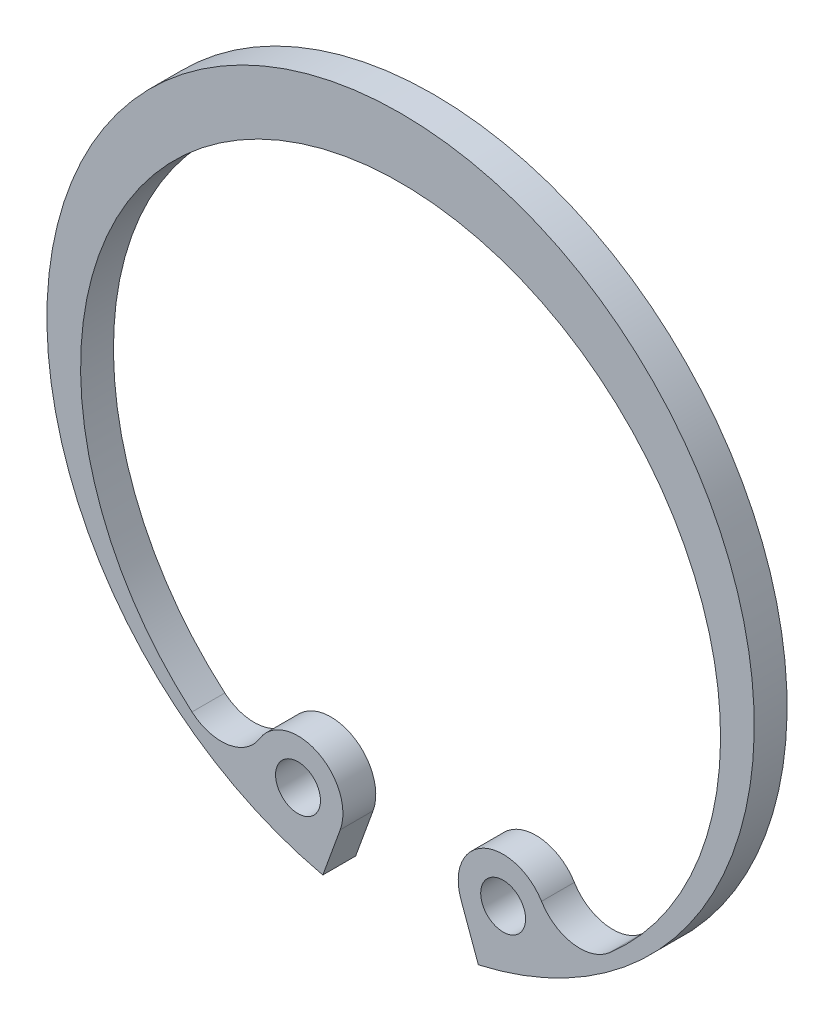
ISO-10303-21;
HEADER;
FILE_DESCRIPTION(('STEP AP214'),'2;1');
FILE_NAME('part.step','',(''),(''),'','','');
FILE_SCHEMA(('AUTOMOTIVE_DESIGN { 1 0 10303 214 1 1 1 1 }'));
ENDSEC;
DATA;
#1=APPLICATION_CONTEXT('core data for automotive mechanical design processes');
#2=APPLICATION_PROTOCOL_DEFINITION('international standard','automotive_design',2000,#1);
#3=PRODUCT_CONTEXT('',#1,'mechanical');
#4=PRODUCT('Part','Part','',(#3));
#5=PRODUCT_RELATED_PRODUCT_CATEGORY('part','',(#4));
#6=PRODUCT_DEFINITION_FORMATION('','',#4);
#7=PRODUCT_DEFINITION_CONTEXT('part definition',#1,'design');
#8=PRODUCT_DEFINITION('design','',#6,#7);
#9=PRODUCT_DEFINITION_SHAPE('','',#8);
#10=(LENGTH_UNIT() NAMED_UNIT(*) SI_UNIT(.MILLI.,.METRE.));
#11=(NAMED_UNIT(*) PLANE_ANGLE_UNIT() SI_UNIT($,.RADIAN.));
#12=(NAMED_UNIT(*) SI_UNIT($,.STERADIAN.) SOLID_ANGLE_UNIT());
#13=UNCERTAINTY_MEASURE_WITH_UNIT(LENGTH_MEASURE(1.E-05),#10,'distance_accuracy_value','');
#14=(GEOMETRIC_REPRESENTATION_CONTEXT(3) GLOBAL_UNCERTAINTY_ASSIGNED_CONTEXT((#13)) GLOBAL_UNIT_ASSIGNED_CONTEXT((#10,
#11,#12)) REPRESENTATION_CONTEXT('',''));
#15=CARTESIAN_POINT('',(0.,0.,0.));
#16=DIRECTION('',(0.,0.,1.));
#17=DIRECTION('',(1.,0.,0.));
#18=AXIS2_PLACEMENT_3D('',#15,#16,#17);
#19=CARTESIAN_POINT('',(0.,0.,0.975));
#20=DIRECTION('',(0.,0.,-1.));
#21=DIRECTION('',(-1.,0.,0.));
#22=AXIS2_PLACEMENT_3D('',#19,#20,#21);
#23=PLANE('',#22);
#24=CARTESIAN_POINT('',(-5.32360078088962,-6.98043795968956,0.975));
#25=DIRECTION('',(0.,0.,-1.));
#26=DIRECTION('',(-1.,0.,0.));
#27=AXIS2_PLACEMENT_3D('',#24,#25,#26);
#28=CIRCLE('',#27,1.33333333333333);
#29=CARTESIAN_POINT('',(-6.19276009205528,-7.99154619800622,0.975));
#30=VERTEX_POINT('',#29);
#31=CARTESIAN_POINT('',(-4.18415582842588,-7.67285617008172,0.975));
#32=VERTEX_POINT('',#31);
#33=EDGE_CURVE('E140',#30,#32,#28,.F.);
#34=ORIENTED_EDGE('',*,*,#33,.T.);
#35=CARTESIAN_POINT('',(-3.04471087596214,-8.36527438047387,0.975));
#36=DIRECTION('',(0.,0.,-1.));
#37=DIRECTION('',(-1.,0.,0.));
#38=AXIS2_PLACEMENT_3D('',#35,#36,#37);
#39=CIRCLE('',#38,1.33333333333333);
#40=CARTESIAN_POINT('',(-1.79178738158093,-8.82130123824143,0.975));
#41=VERTEX_POINT('',#40);
#42=EDGE_CURVE('E96',#41,#32,#39,.F.);
#43=ORIENTED_EDGE('',*,*,#42,.F.);
#44=DIRECTION('',(-0.34202014332567,-0.939692620785908,0.));
#45=VECTOR('',#44,1.);
#46=CARTESIAN_POINT('',(-1.79178738158093,-8.82130123824143,0.975));
#47=LINE('',#46,#45);
#48=CARTESIAN_POINT('',(-2.30921625274565,-10.2429253779404,0.975));
#49=VERTEX_POINT('',#48);
#50=EDGE_CURVE('E93',#41,#49,#47,.T.);
#51=ORIENTED_EDGE('',*,*,#50,.T.);
#52=CARTESIAN_POINT('',(0.,0.,0.975));
#53=DIRECTION('',(0.,0.,-1.));
#54=DIRECTION('',(-1.,0.,0.));
#55=AXIS2_PLACEMENT_3D('',#52,#53,#54);
#56=CIRCLE('',#55,10.5);
#57=CARTESIAN_POINT('',(2.30921625274565,-10.2429253779404,0.975));
#58=VERTEX_POINT('',#57);
#59=EDGE_CURVE('E81',#58,#49,#56,.F.);
#60=ORIENTED_EDGE('',*,*,#59,.F.);
#61=DIRECTION('',(-0.34202014332567,0.939692620785908,0.));
#62=VECTOR('',#61,1.);
#63=CARTESIAN_POINT('',(1.79178738158093,-8.82130123824143,0.975));
#64=LINE('',#63,#62);
#65=CARTESIAN_POINT('',(1.79178738158093,-8.82130123824143,0.975));
#66=VERTEX_POINT('',#65);
#67=EDGE_CURVE('E108',#58,#66,#64,.T.);
#68=ORIENTED_EDGE('',*,*,#67,.T.);
#69=CARTESIAN_POINT('',(3.04471087596214,-8.36527438047387,0.975));
#70=DIRECTION('',(0.,0.,-1.));
#71=DIRECTION('',(-1.,0.,0.));
#72=AXIS2_PLACEMENT_3D('',#69,#70,#71);
#73=CIRCLE('',#72,1.33333333333333);
#74=CARTESIAN_POINT('',(4.18415582842588,-7.67285617008171,0.975));
#75=VERTEX_POINT('',#74);
#76=EDGE_CURVE('E129',#75,#66,#73,.F.);
#77=ORIENTED_EDGE('',*,*,#76,.F.);
#78=CARTESIAN_POINT('',(5.32360078088962,-6.98043795968956,0.975));
#79=DIRECTION('',(0.,0.,-1.));
#80=DIRECTION('',(-1.,0.,0.));
#81=AXIS2_PLACEMENT_3D('',#78,#79,#80);
#82=CIRCLE('',#81,1.33333333333333);
#83=CARTESIAN_POINT('',(6.19276009205528,-7.99154619800622,0.975));
#84=VERTEX_POINT('',#83);
#85=EDGE_CURVE('E133',#75,#84,#82,.F.);
#86=ORIENTED_EDGE('',*,*,#85,.T.);
#87=CARTESIAN_POINT('',(0.,-0.7874,0.975));
#88=DIRECTION('',(0.,0.,-1.));
#89=DIRECTION('',(-1.,0.,0.));
#90=AXIS2_PLACEMENT_3D('',#87,#88,#89);
#91=CIRCLE('',#90,9.5);
#92=EDGE_CURVE('E137',#84,#30,#91,.F.);
#93=ORIENTED_EDGE('',*,*,#92,.T.);
#94=EDGE_LOOP('',(#34,#43,#51,#60,#68,#77,#86,#93));
#95=FACE_BOUND('',#94,.T.);
#96=CARTESIAN_POINT('',(3.04471087596214,-8.36527438047387,0.975));
#97=DIRECTION('',(0.,0.,-1.));
#98=DIRECTION('',(-1.,0.,0.));
#99=AXIS2_PLACEMENT_3D('',#96,#97,#98);
#100=CIRCLE('',#99,0.666666666666667);
#101=CARTESIAN_POINT('',(2.37804420929547,-8.36527438047387,0.975));
#102=VERTEX_POINT('',#101);
#103=EDGE_CURVE('E20',#102,#102,#100,.F.);
#104=ORIENTED_EDGE('',*,*,#103,.T.);
#105=EDGE_LOOP('',(#104));
#106=FACE_BOUND('',#105,.T.);
#107=CARTESIAN_POINT('',(-3.04471087596214,-8.36527438047387,0.975));
#108=DIRECTION('',(0.,0.,-1.));
#109=DIRECTION('',(-1.,0.,0.));
#110=AXIS2_PLACEMENT_3D('',#107,#108,#109);
#111=CIRCLE('',#110,0.666666666666667);
#112=CARTESIAN_POINT('',(-3.71137754262881,-8.36527438047387,0.975));
#113=VERTEX_POINT('',#112);
#114=EDGE_CURVE('E109',#113,#113,#111,.F.);
#115=ORIENTED_EDGE('',*,*,#114,.T.);
#116=EDGE_LOOP('',(#115));
#117=FACE_BOUND('',#116,.T.);
#118=ADVANCED_FACE('F17',(#95,#106,#117),#23,.T.);
#119=CARTESIAN_POINT('',(3.04471087596214,-8.36527438047387,1.95));
#120=DIRECTION('',(0.,0.,-1.));
#121=DIRECTION('',(-1.,0.,0.));
#122=AXIS2_PLACEMENT_3D('',#119,#120,#121);
#123=CYLINDRICAL_SURFACE('',#122,0.666666666666667);
#124=CARTESIAN_POINT('',(3.04471087596214,-8.36527438047387,1.95));
#125=DIRECTION('',(0.,0.,-1.));
#126=DIRECTION('',(-1.,0.,0.));
#127=AXIS2_PLACEMENT_3D('',#124,#125,#126);
#128=CIRCLE('',#127,0.666666666666667);
#129=CARTESIAN_POINT('',(2.37804420929547,-8.36527438047387,1.95));
#130=VERTEX_POINT('',#129);
#131=EDGE_CURVE('E124',#130,#130,#128,.T.);
#132=ORIENTED_EDGE('',*,*,#131,.F.);
#133=EDGE_LOOP('',(#132));
#134=FACE_BOUND('',#133,.T.);
#135=ORIENTED_EDGE('',*,*,#103,.F.);
#136=EDGE_LOOP('',(#135));
#137=FACE_BOUND('',#136,.T.);
#138=ADVANCED_FACE('F265',(#134,#137),#123,.F.);
#139=CARTESIAN_POINT('',(0.,0.,0.975));
#140=DIRECTION('',(0.,0.,-1.));
#141=DIRECTION('',(-1.,0.,0.));
#142=AXIS2_PLACEMENT_3D('',#139,#140,#141);
#143=CYLINDRICAL_SURFACE('',#142,10.5);
#144=ORIENTED_EDGE('',*,*,#59,.T.);
#145=DIRECTION('',(0.,0.,1.));
#146=VECTOR('',#145,1.);
#147=CARTESIAN_POINT('',(-2.30921625274565,-10.2429253779404,1.95));
#148=LINE('',#147,#146);
#149=CARTESIAN_POINT('',(-2.30921625274565,-10.2429253779404,1.95));
#150=VERTEX_POINT('',#149);
#151=EDGE_CURVE('E85',#49,#150,#148,.T.);
#152=ORIENTED_EDGE('',*,*,#151,.T.);
#153=CARTESIAN_POINT('',(0.,0.,1.95));
#154=DIRECTION('',(0.,0.,-1.));
#155=DIRECTION('',(-1.,0.,0.));
#156=AXIS2_PLACEMENT_3D('',#153,#154,#155);
#157=CIRCLE('',#156,10.5);
#158=CARTESIAN_POINT('',(2.30921625274565,-10.2429253779404,1.95));
#159=VERTEX_POINT('',#158);
#160=EDGE_CURVE('E122',#159,#150,#157,.F.);
#161=ORIENTED_EDGE('',*,*,#160,.F.);
#162=DIRECTION('',(0.,0.,1.));
#163=VECTOR('',#162,1.);
#164=CARTESIAN_POINT('',(2.30921625274565,-10.2429253779404,1.95));
#165=LINE('',#164,#163);
#166=EDGE_CURVE('E88',#159,#58,#165,.F.);
#167=ORIENTED_EDGE('',*,*,#166,.T.);
#168=EDGE_LOOP('',(#144,#152,#161,#167));
#169=FACE_BOUND('',#168,.T.);
#170=ADVANCED_FACE('F83',(#169),#143,.T.);
#171=CARTESIAN_POINT('',(-1.79178738158093,-8.82130123824143,1.95));
#172=DIRECTION('',(-0.939692620785908,0.34202014332567,0.));
#173=DIRECTION('',(-0.34202014332567,-0.939692620785908,0.));
#174=AXIS2_PLACEMENT_3D('',#171,#172,#173);
#175=PLANE('',#174);
#176=DIRECTION('',(0.,0.,-1.));
#177=VECTOR('',#176,1.);
#178=CARTESIAN_POINT('',(-1.79178738158093,-8.82130123824143,1.95));
#179=LINE('',#178,#177);
#180=CARTESIAN_POINT('',(-1.79178738158093,-8.82130123824143,1.95));
#181=VERTEX_POINT('',#180);
#182=EDGE_CURVE('E106',#181,#41,#179,.T.);
#183=ORIENTED_EDGE('',*,*,#182,.F.);
#184=DIRECTION('',(0.342020143325669,0.939692620785908,0.));
#185=VECTOR('',#184,1.);
#186=CARTESIAN_POINT('',(-2.30921625274565,-10.2429253779404,1.95));
#187=LINE('',#186,#185);
#188=EDGE_CURVE('E102',#150,#181,#187,.T.);
#189=ORIENTED_EDGE('',*,*,#188,.F.);
#190=ORIENTED_EDGE('',*,*,#151,.F.);
#191=ORIENTED_EDGE('',*,*,#50,.F.);
#192=EDGE_LOOP('',(#183,#189,#190,#191));
#193=FACE_BOUND('',#192,.T.);
#194=ADVANCED_FACE('F100',(#193),#175,.F.);
#195=CARTESIAN_POINT('',(-3.04471087596214,-8.36527438047387,1.95));
#196=DIRECTION('',(0.,0.,-1.));
#197=DIRECTION('',(-1.,0.,0.));
#198=AXIS2_PLACEMENT_3D('',#195,#196,#197);
#199=CYLINDRICAL_SURFACE('',#198,1.33333333333333);
#200=CARTESIAN_POINT('',(-3.04471087596214,-8.36527438047387,1.95));
#201=DIRECTION('',(0.,0.,-1.));
#202=DIRECTION('',(-1.,0.,0.));
#203=AXIS2_PLACEMENT_3D('',#200,#201,#202);
#204=CIRCLE('',#203,1.33333333333333);
#205=CARTESIAN_POINT('',(-4.18415582842588,-7.67285617008172,1.95));
#206=VERTEX_POINT('',#205);
#207=EDGE_CURVE('E119',#181,#206,#204,.F.);
#208=ORIENTED_EDGE('',*,*,#207,.F.);
#209=ORIENTED_EDGE('',*,*,#182,.T.);
#210=ORIENTED_EDGE('',*,*,#42,.T.);
#211=DIRECTION('',(0.,0.,-1.));
#212=VECTOR('',#211,1.);
#213=CARTESIAN_POINT('',(-4.18415582842588,-7.67285617008172,1.95));
#214=LINE('',#213,#212);
#215=EDGE_CURVE('E142',#32,#206,#214,.F.);
#216=ORIENTED_EDGE('',*,*,#215,.T.);
#217=EDGE_LOOP('',(#208,#209,#210,#216));
#218=FACE_BOUND('',#217,.T.);
#219=ADVANCED_FACE('F176',(#218),#199,.T.);
#220=CARTESIAN_POINT('',(-5.32360078088962,-6.98043795968956,1.95));
#221=DIRECTION('',(0.,0.,-1.));
#222=DIRECTION('',(-1.,0.,0.));
#223=AXIS2_PLACEMENT_3D('',#220,#221,#222);
#224=CYLINDRICAL_SURFACE('',#223,1.33333333333333);
#225=DIRECTION('',(0.,0.,-1.));
#226=VECTOR('',#225,1.);
#227=CARTESIAN_POINT('',(-6.19276009205527,-7.99154619800622,1.95));
#228=LINE('',#227,#226);
#229=CARTESIAN_POINT('',(-6.19276009205528,-7.99154619800622,1.95));
#230=VERTEX_POINT('',#229);
#231=EDGE_CURVE('E139',#30,#230,#228,.F.);
#232=ORIENTED_EDGE('',*,*,#231,.T.);
#233=CARTESIAN_POINT('',(-5.32360078088962,-6.98043795968956,1.95));
#234=DIRECTION('',(0.,0.,-1.));
#235=DIRECTION('',(-1.,0.,0.));
#236=AXIS2_PLACEMENT_3D('',#233,#234,#235);
#237=CIRCLE('',#236,1.33333333333333);
#238=EDGE_CURVE('E116',#206,#230,#237,.T.);
#239=ORIENTED_EDGE('',*,*,#238,.F.);
#240=ORIENTED_EDGE('',*,*,#215,.F.);
#241=ORIENTED_EDGE('',*,*,#33,.F.);
#242=EDGE_LOOP('',(#232,#239,#240,#241));
#243=FACE_BOUND('',#242,.T.);
#244=ADVANCED_FACE('F175',(#243),#224,.F.);
#245=CARTESIAN_POINT('',(0.,-0.7874,1.95));
#246=DIRECTION('',(0.,0.,-1.));
#247=DIRECTION('',(-1.,0.,0.));
#248=AXIS2_PLACEMENT_3D('',#245,#246,#247);
#249=CYLINDRICAL_SURFACE('',#248,9.5);
#250=DIRECTION('',(0.,0.,-1.));
#251=VECTOR('',#250,1.);
#252=CARTESIAN_POINT('',(6.19276009205528,-7.99154619800622,1.95));
#253=LINE('',#252,#251);
#254=CARTESIAN_POINT('',(6.19276009205528,-7.99154619800622,1.95));
#255=VERTEX_POINT('',#254);
#256=EDGE_CURVE('E136',#84,#255,#253,.F.);
#257=ORIENTED_EDGE('',*,*,#256,.T.);
#258=CARTESIAN_POINT('',(0.,-0.7874,1.95));
#259=DIRECTION('',(0.,0.,-1.));
#260=DIRECTION('',(-1.,0.,0.));
#261=AXIS2_PLACEMENT_3D('',#258,#259,#260);
#262=CIRCLE('',#261,9.5);
#263=EDGE_CURVE('E114',#230,#255,#262,.T.);
#264=ORIENTED_EDGE('',*,*,#263,.F.);
#265=ORIENTED_EDGE('',*,*,#231,.F.);
#266=ORIENTED_EDGE('',*,*,#92,.F.);
#267=EDGE_LOOP('',(#257,#264,#265,#266));
#268=FACE_BOUND('',#267,.T.);
#269=ADVANCED_FACE('F172',(#268),#249,.F.);
#270=CARTESIAN_POINT('',(5.32360078088962,-6.98043795968956,1.95));
#271=DIRECTION('',(0.,0.,-1.));
#272=DIRECTION('',(-1.,0.,0.));
#273=AXIS2_PLACEMENT_3D('',#270,#271,#272);
#274=CYLINDRICAL_SURFACE('',#273,1.33333333333333);
#275=DIRECTION('',(0.,0.,-1.));
#276=VECTOR('',#275,1.);
#277=CARTESIAN_POINT('',(4.18415582842588,-7.67285617008171,1.95));
#278=LINE('',#277,#276);
#279=CARTESIAN_POINT('',(4.18415582842588,-7.67285617008171,1.95));
#280=VERTEX_POINT('',#279);
#281=EDGE_CURVE('E132',#280,#75,#278,.T.);
#282=ORIENTED_EDGE('',*,*,#281,.F.);
#283=CARTESIAN_POINT('',(5.32360078088962,-6.98043795968956,1.95));
#284=DIRECTION('',(0.,0.,-1.));
#285=DIRECTION('',(-1.,0.,0.));
#286=AXIS2_PLACEMENT_3D('',#283,#284,#285);
#287=CIRCLE('',#286,1.33333333333333);
#288=EDGE_CURVE('E112',#255,#280,#287,.T.);
#289=ORIENTED_EDGE('',*,*,#288,.F.);
#290=ORIENTED_EDGE('',*,*,#256,.F.);
#291=ORIENTED_EDGE('',*,*,#85,.F.);
#292=EDGE_LOOP('',(#282,#289,#290,#291));
#293=FACE_BOUND('',#292,.T.);
#294=ADVANCED_FACE('F166',(#293),#274,.F.);
#295=CARTESIAN_POINT('',(3.04471087596214,-8.36527438047387,1.95));
#296=DIRECTION('',(0.,0.,-1.));
#297=DIRECTION('',(-1.,0.,0.));
#298=AXIS2_PLACEMENT_3D('',#295,#296,#297);
#299=CYLINDRICAL_SURFACE('',#298,1.33333333333333);
#300=ORIENTED_EDGE('',*,*,#76,.T.);
#301=DIRECTION('',(0.,0.,1.));
#302=VECTOR('',#301,1.);
#303=CARTESIAN_POINT('',(1.79178738158093,-8.82130123824143,1.95));
#304=LINE('',#303,#302);
#305=CARTESIAN_POINT('',(1.79178738158093,-8.82130123824143,1.95));
#306=VERTEX_POINT('',#305);
#307=EDGE_CURVE('E131',#66,#306,#304,.T.);
#308=ORIENTED_EDGE('',*,*,#307,.T.);
#309=CARTESIAN_POINT('',(3.04471087596214,-8.36527438047387,1.95));
#310=DIRECTION('',(0.,0.,-1.));
#311=DIRECTION('',(-1.,0.,0.));
#312=AXIS2_PLACEMENT_3D('',#309,#310,#311);
#313=CIRCLE('',#312,1.33333333333333);
#314=EDGE_CURVE('E35',#280,#306,#313,.F.);
#315=ORIENTED_EDGE('',*,*,#314,.F.);
#316=ORIENTED_EDGE('',*,*,#281,.T.);
#317=EDGE_LOOP('',(#300,#308,#315,#316));
#318=FACE_BOUND('',#317,.T.);
#319=ADVANCED_FACE('F168',(#318),#299,.T.);
#320=CARTESIAN_POINT('',(1.79178738158093,-8.82130123824143,1.95));
#321=DIRECTION('',(0.939692620785908,0.34202014332567,0.));
#322=DIRECTION('',(-0.34202014332567,0.939692620785908,0.));
#323=AXIS2_PLACEMENT_3D('',#320,#321,#322);
#324=PLANE('',#323);
#325=ORIENTED_EDGE('',*,*,#166,.F.);
#326=DIRECTION('',(0.342020143325669,-0.939692620785908,0.));
#327=VECTOR('',#326,1.);
#328=CARTESIAN_POINT('',(1.79178738158093,-8.82130123824143,1.95));
#329=LINE('',#328,#327);
#330=EDGE_CURVE('E26',#306,#159,#329,.T.);
#331=ORIENTED_EDGE('',*,*,#330,.F.);
#332=ORIENTED_EDGE('',*,*,#307,.F.);
#333=ORIENTED_EDGE('',*,*,#67,.F.);
#334=EDGE_LOOP('',(#325,#331,#332,#333));
#335=FACE_BOUND('',#334,.T.);
#336=ADVANCED_FACE('F161',(#335),#324,.F.);
#337=CARTESIAN_POINT('',(-3.04471087596214,-8.36527438047387,1.95));
#338=DIRECTION('',(0.,0.,-1.));
#339=DIRECTION('',(-1.,0.,0.));
#340=AXIS2_PLACEMENT_3D('',#337,#338,#339);
#341=CYLINDRICAL_SURFACE('',#340,0.666666666666667);
#342=CARTESIAN_POINT('',(-3.04471087596214,-8.36527438047387,1.95));
#343=DIRECTION('',(0.,0.,-1.));
#344=DIRECTION('',(-1.,0.,0.));
#345=AXIS2_PLACEMENT_3D('',#342,#343,#344);
#346=CIRCLE('',#345,0.666666666666667);
#347=CARTESIAN_POINT('',(-3.71137754262881,-8.36527438047387,1.95));
#348=VERTEX_POINT('',#347);
#349=EDGE_CURVE('E11',#348,#348,#346,.T.);
#350=ORIENTED_EDGE('',*,*,#349,.F.);
#351=EDGE_LOOP('',(#350));
#352=FACE_BOUND('',#351,.T.);
#353=ORIENTED_EDGE('',*,*,#114,.F.);
#354=EDGE_LOOP('',(#353));
#355=FACE_BOUND('',#354,.T.);
#356=ADVANCED_FACE('F187',(#352,#355),#341,.F.);
#357=CARTESIAN_POINT('',(0.,0.,1.95));
#358=DIRECTION('',(0.,0.,1.));
#359=DIRECTION('',(1.,0.,0.));
#360=AXIS2_PLACEMENT_3D('',#357,#358,#359);
#361=PLANE('',#360);
#362=ORIENTED_EDGE('',*,*,#349,.T.);
#363=EDGE_LOOP('',(#362));
#364=FACE_BOUND('',#363,.T.);
#365=ORIENTED_EDGE('',*,*,#314,.T.);
#366=ORIENTED_EDGE('',*,*,#330,.T.);
#367=ORIENTED_EDGE('',*,*,#160,.T.);
#368=ORIENTED_EDGE('',*,*,#188,.T.);
#369=ORIENTED_EDGE('',*,*,#207,.T.);
#370=ORIENTED_EDGE('',*,*,#238,.T.);
#371=ORIENTED_EDGE('',*,*,#263,.T.);
#372=ORIENTED_EDGE('',*,*,#288,.T.);
#373=EDGE_LOOP('',(#365,#366,#367,#368,#369,#370,#371,#372));
#374=FACE_BOUND('',#373,.T.);
#375=ORIENTED_EDGE('',*,*,#131,.T.);
#376=EDGE_LOOP('',(#375));
#377=FACE_BOUND('',#376,.T.);
#378=ADVANCED_FACE('F157',(#364,#374,#377),#361,.T.);
#379=CLOSED_SHELL('',(#118,#138,#170,#194,#219,#244,#269,#294,#319,#336,#356,#378));
#380=MANIFOLD_SOLID_BREP('B1',#379);
#381=ADVANCED_BREP_SHAPE_REPRESENTATION('',(#18,#380),#14);
#382=SHAPE_DEFINITION_REPRESENTATION(#9,#381);
ENDSEC;
END-ISO-10303-21;
